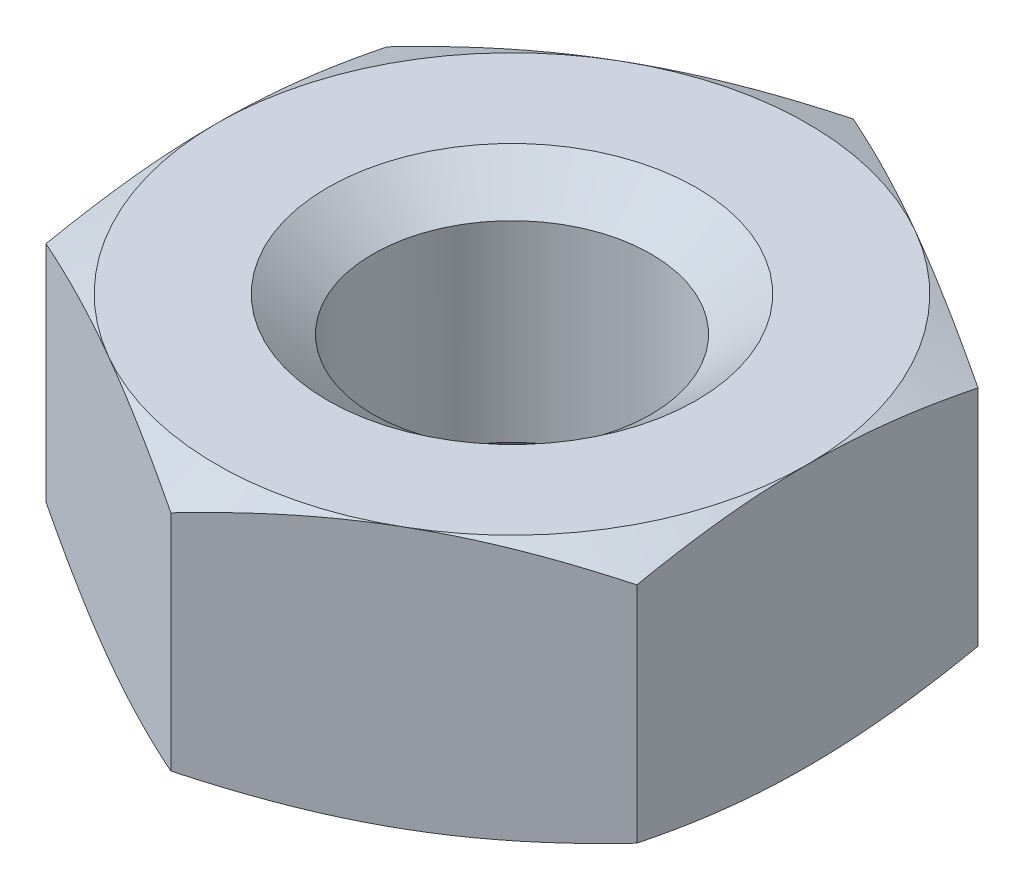
ISO-10303-21;
HEADER;
FILE_DESCRIPTION(('STEP AP214'),'2;1');
FILE_NAME('part.step','',(''),(''),'','','');
FILE_SCHEMA(('AUTOMOTIVE_DESIGN { 1 0 10303 214 1 1 1 1 }'));
ENDSEC;
DATA;
#1=APPLICATION_CONTEXT('core data for automotive mechanical design processes');
#2=APPLICATION_PROTOCOL_DEFINITION('international standard','automotive_design',2000,#1);
#3=PRODUCT_CONTEXT('',#1,'mechanical');
#4=PRODUCT('Part','Part','',(#3));
#5=PRODUCT_RELATED_PRODUCT_CATEGORY('part','',(#4));
#6=PRODUCT_DEFINITION_FORMATION('','',#4);
#7=PRODUCT_DEFINITION_CONTEXT('part definition',#1,'design');
#8=PRODUCT_DEFINITION('design','',#6,#7);
#9=PRODUCT_DEFINITION_SHAPE('','',#8);
#10=(LENGTH_UNIT() NAMED_UNIT(*) SI_UNIT(.MILLI.,.METRE.));
#11=(NAMED_UNIT(*) PLANE_ANGLE_UNIT() SI_UNIT($,.RADIAN.));
#12=(NAMED_UNIT(*) SI_UNIT($,.STERADIAN.) SOLID_ANGLE_UNIT());
#13=UNCERTAINTY_MEASURE_WITH_UNIT(LENGTH_MEASURE(1.E-05),#10,'distance_accuracy_value','');
#14=(GEOMETRIC_REPRESENTATION_CONTEXT(3) GLOBAL_UNCERTAINTY_ASSIGNED_CONTEXT((#13)) GLOBAL_UNIT_ASSIGNED_CONTEXT((#10,
#11,#12)) REPRESENTATION_CONTEXT('',''));
#15=CARTESIAN_POINT('',(0.,0.,0.));
#16=DIRECTION('',(0.,0.,1.));
#17=DIRECTION('',(1.,0.,0.));
#18=AXIS2_PLACEMENT_3D('',#15,#16,#17);
#19=CARTESIAN_POINT('',(0.,-1.52500000000001,0.));
#20=DIRECTION('',(0.,1.,0.));
#21=DIRECTION('',(0.,0.,1.));
#22=AXIS2_PLACEMENT_3D('',#19,#20,#21);
#23=CONICAL_SURFACE('',#22,3.44499999999997,1.17809724509618);
#24=CARTESIAN_POINT('',(3.44499999999999,-1.52500000000001,0.));
#25=CARTESIAN_POINT('',(3.44499999999999,-1.52500653519659,-0.0836770238553707));
#26=CARTESIAN_POINT('',(3.44499999999999,-1.523736539951,-0.167348336923047));
#27=CARTESIAN_POINT('',(3.44499999999999,-1.51869977778039,-0.334608821328024));
#28=CARTESIAN_POINT('',(3.44499999999999,-1.51493322636125,-0.418197999131677));
#29=CARTESIAN_POINT('',(3.44499999999999,-1.50000011813595,-0.668300761406539));
#30=CARTESIAN_POINT('',(3.44499999999999,-1.48519949166168,-0.834608265477263));
#31=CARTESIAN_POINT('',(3.44499999999999,-1.44691557663054,-1.16608574327092));
#32=CARTESIAN_POINT('',(3.44499999999999,-1.42343721863474,-1.33125630880567));
#33=CARTESIAN_POINT('',(3.44499999999999,-1.36907122689802,-1.66083827114248));
#34=CARTESIAN_POINT('',(3.44499999999999,-1.33816390417375,-1.82524644688072));
#35=CARTESIAN_POINT('',(3.44499999999999,-1.30424763449981,-1.98897167735825));
#36=B_SPLINE_CURVE_WITH_KNOTS('',3,(#24,#25,#26,#27,#28,#29,#30,#31,#32,#33,#34,#35),
.UNSPECIFIED.,.F.,.F.,(4,2,2,2,2,4),(0.,0.251010681069905,0.501999697400777,1.00260384828627,
1.50292399932506,2.00458506025341),.UNSPECIFIED.);
#37=CARTESIAN_POINT('',(3.44499999999999,-1.525,0.));
#38=VERTEX_POINT('',#37);
#39=CARTESIAN_POINT('',(3.44499999999999,-1.30424763449981,-1.98897167735825));
#40=VERTEX_POINT('',#39);
#41=EDGE_CURVE('E251',#38,#40,#36,.T.);
#42=ORIENTED_EDGE('',*,*,#41,.F.);
#43=CARTESIAN_POINT('',(0.,-1.525,0.));
#44=DIRECTION('',(0.,1.,0.));
#45=DIRECTION('',(0.,0.,1.));
#46=AXIS2_PLACEMENT_3D('',#43,#44,#45);
#47=CIRCLE('',#46,3.44499999999998);
#48=CARTESIAN_POINT('',(1.7225,-1.525,-2.98345751603738));
#49=VERTEX_POINT('',#48);
#50=EDGE_CURVE('E113',#49,#38,#47,.F.);
#51=ORIENTED_EDGE('',*,*,#50,.F.);
#52=CARTESIAN_POINT('',(3.44499999999998,-1.30424763449981,-1.98897167735824));
#53=CARTESIAN_POINT('',(3.30320979116598,-1.33816390417375,-2.07083429259701));
#54=CARTESIAN_POINT('',(3.16082813438681,-1.36907122689802,-2.15303838046613));
#55=CARTESIAN_POINT('',(2.875401782374,-1.42343721863474,-2.31782936163454));
#56=CARTESIAN_POINT('',(2.73235987666347,-1.44691557663055,-2.40041464440191));
#57=CARTESIAN_POINT('',(2.44529196011177,-1.48519949166168,-2.56615338329874));
#58=CARTESIAN_POINT('',(2.30126543674653,-1.50000011813595,-2.6493071353341));
#59=CARTESIAN_POINT('',(2.08467009105984,-1.51493322636125,-2.77435851647153));
#60=CARTESIAN_POINT('',(2.01227973960043,-1.51869977778039,-2.81615310537336));
#61=CARTESIAN_POINT('',(1.86742791105642,-1.52373653995101,-2.89978334757585));
#62=CARTESIAN_POINT('',(1.79496642837181,-1.52500653519659,-2.94161900410969));
#63=CARTESIAN_POINT('',(1.72249999999999,-1.52500000000001,-2.98345751603737));
#64=B_SPLINE_CURVE_WITH_KNOTS('',3,(#52,#53,#54,#55,#56,#57,#58,#59,#60,#61,#62,#63),
.UNSPECIFIED.,.F.,.F.,(4,2,2,2,2,4),(0.,0.501661060928354,1.00198121196715,1.50258536285264,
1.75357437918352,2.00458506025342),.UNSPECIFIED.);
#65=EDGE_CURVE('E250',#40,#49,#64,.T.);
#66=ORIENTED_EDGE('',*,*,#65,.F.);
#67=EDGE_LOOP('',(#42,#51,#66));
#68=FACE_BOUND('',#67,.T.);
#69=ADVANCED_FACE('F16',(#68),#23,.T.);
#70=CARTESIAN_POINT('',(0.,-1.11908402335913,0.));
#71=DIRECTION('',(0.,-1.,0.));
#72=DIRECTION('',(0.,0.,-1.));
#73=AXIS2_PLACEMENT_3D('',#70,#71,#72);
#74=CONICAL_SURFACE('',#73,1.621,0.916297857297024);
#75=CARTESIAN_POINT('',(0.,-1.11908402335913,0.));
#76=DIRECTION('',(0.,-1.,0.));
#77=DIRECTION('',(0.,0.,-1.));
#78=AXIS2_PLACEMENT_3D('',#75,#76,#77);
#79=CIRCLE('',#78,1.621);
#80=CARTESIAN_POINT('',(0.,-1.11908402335913,-1.621));
#81=VERTEX_POINT('',#80);
#82=EDGE_CURVE('E245',#81,#81,#79,.T.);
#83=ORIENTED_EDGE('',*,*,#82,.F.);
#84=EDGE_LOOP('',(#83));
#85=FACE_BOUND('',#84,.T.);
#86=CARTESIAN_POINT('',(0.,-1.525,0.));
#87=DIRECTION('',(0.,-1.,0.));
#88=DIRECTION('',(0.,0.,-1.));
#89=AXIS2_PLACEMENT_3D('',#86,#87,#88);
#90=CIRCLE('',#89,2.15);
#91=CARTESIAN_POINT('',(0.,-1.525,-2.15));
#92=VERTEX_POINT('',#91);
#93=EDGE_CURVE('E356',#92,#92,#90,.F.);
#94=ORIENTED_EDGE('',*,*,#93,.F.);
#95=EDGE_LOOP('',(#94));
#96=FACE_BOUND('',#95,.T.);
#97=ADVANCED_FACE('F526',(#85,#96),#74,.F.);
#98=CARTESIAN_POINT('',(0.,-1.52500000000001,0.));
#99=DIRECTION('',(0.,1.,0.));
#100=DIRECTION('',(0.,0.,1.));
#101=AXIS2_PLACEMENT_3D('',#98,#99,#100);
#102=CONICAL_SURFACE('',#101,3.44499999999995,1.17809724509617);
#103=CARTESIAN_POINT('',(0.,-1.525,0.));
#104=DIRECTION('',(0.,1.,0.));
#105=DIRECTION('',(0.,0.,1.));
#106=AXIS2_PLACEMENT_3D('',#103,#104,#105);
#107=CIRCLE('',#106,3.44499999999998);
#108=CARTESIAN_POINT('',(-1.72249999999999,-1.525,-2.9834575160374));
#109=VERTEX_POINT('',#108);
#110=EDGE_CURVE('E21',#109,#49,#107,.F.);
#111=ORIENTED_EDGE('',*,*,#110,.F.);
#112=CARTESIAN_POINT('',(0.,-1.3042476344998,-3.97794335471651));
#113=CARTESIAN_POINT('',(-0.141790208834029,-1.33816390417374,-3.89608073947775));
#114=CARTESIAN_POINT('',(-0.284171865613201,-1.36907122689801,-3.81387665160863));
#115=CARTESIAN_POINT('',(-0.569598217625999,-1.42343721863473,-3.64908567044023));
#116=CARTESIAN_POINT('',(-0.712640123336535,-1.44691557663054,-3.56650038767285));
#117=CARTESIAN_POINT('',(-0.99970803988823,-1.48519949166167,-3.40076164877602));
#118=CARTESIAN_POINT('',(-1.14373456325346,-1.50000011813594,-3.31760789674066));
#119=CARTESIAN_POINT('',(-1.36032990894015,-1.51493322636124,-3.19255651560323));
#120=CARTESIAN_POINT('',(-1.43272026039957,-1.51869977778038,-3.15076192670141));
#121=CARTESIAN_POINT('',(-1.57757208894356,-1.523736539951,-3.06713168449892));
#122=CARTESIAN_POINT('',(-1.65003357162817,-1.52500653519658,-3.02529602796508));
#123=CARTESIAN_POINT('',(-1.7225,-1.525,-2.9834575160374));
#124=B_SPLINE_CURVE_WITH_KNOTS('',3,(#112,#113,#114,#115,#116,#117,#118,#119,#120,#121,#122,
#123),.UNSPECIFIED.,.F.,.F.,(4,2,2,2,2,4),(0.,0.501661060928347,1.00198121196714,
1.50258536285262,1.75357437918349,2.0045850602534),.UNSPECIFIED.);
#125=CARTESIAN_POINT('',(0.,-1.3042476344998,-3.97794335471651));
#126=VERTEX_POINT('',#125);
#127=EDGE_CURVE('E108',#126,#109,#124,.T.);
#128=ORIENTED_EDGE('',*,*,#127,.F.);
#129=CARTESIAN_POINT('',(1.72249999999999,-1.52500000000001,-2.98345751603737));
#130=CARTESIAN_POINT('',(1.65003357162816,-1.52500653519659,-3.02529602796506));
#131=CARTESIAN_POINT('',(1.57757208894355,-1.52373653995101,-3.0671316844989));
#132=CARTESIAN_POINT('',(1.43272026039955,-1.51869977778039,-3.15076192670139));
#133=CARTESIAN_POINT('',(1.36032990894013,-1.51493322636125,-3.19255651560321));
#134=CARTESIAN_POINT('',(1.14373456325343,-1.50000011813595,-3.31760789674065));
#135=CARTESIAN_POINT('',(0.999708039888201,-1.48519949166168,-3.40076164877601));
#136=CARTESIAN_POINT('',(0.712640123336499,-1.44691557663054,-3.56650038767284));
#137=CARTESIAN_POINT('',(0.569598217625959,-1.42343721863474,-3.64908567044022));
#138=CARTESIAN_POINT('',(0.284171865613155,-1.36907122689801,-3.81387665160862));
#139=CARTESIAN_POINT('',(0.14179020883398,-1.33816390417374,-3.89608073947775));
#140=CARTESIAN_POINT('',(0.,-1.3042476344998,-3.97794335471651));
#141=B_SPLINE_CURVE_WITH_KNOTS('',3,(#129,#130,#131,#132,#133,#134,#135,#136,#137,#138,#139,
#140),.UNSPECIFIED.,.F.,.F.,(4,2,2,2,2,4),(0.,0.251010681069908,0.501999697400784,
1.00260384828628,1.50292399932508,2.00458506025344),.UNSPECIFIED.);
#142=EDGE_CURVE('E110',#49,#126,#141,.T.);
#143=ORIENTED_EDGE('',*,*,#142,.F.);
#144=EDGE_LOOP('',(#111,#128,#143));
#145=FACE_BOUND('',#144,.T.);
#146=ADVANCED_FACE('F107',(#145),#102,.T.);
#147=CARTESIAN_POINT('',(-3.455,-1.525,3.98794335471652));
#148=DIRECTION('',(0.,-1.,0.));
#149=DIRECTION('',(0.,0.,-1.));
#150=AXIS2_PLACEMENT_3D('',#147,#148,#149);
#151=PLANE('',#150);
#152=ORIENTED_EDGE('',*,*,#93,.T.);
#153=EDGE_LOOP('',(#152));
#154=FACE_BOUND('',#153,.T.);
#155=CARTESIAN_POINT('',(0.,-1.52500000000001,0.));
#156=DIRECTION('',(0.,1.,0.));
#157=DIRECTION('',(0.,0.,1.));
#158=AXIS2_PLACEMENT_3D('',#155,#156,#157);
#159=CIRCLE('',#158,3.44499999999998);
#160=CARTESIAN_POINT('',(1.7225,-1.525,2.98345751603739));
#161=VERTEX_POINT('',#160);
#162=EDGE_CURVE('E347',#161,#38,#159,.T.);
#163=ORIENTED_EDGE('',*,*,#162,.F.);
#164=CARTESIAN_POINT('',(0.,-1.525,0.));
#165=DIRECTION('',(0.,1.,0.));
#166=DIRECTION('',(0.,0.,1.));
#167=AXIS2_PLACEMENT_3D('',#164,#165,#166);
#168=CIRCLE('',#167,3.44499999999999);
#169=CARTESIAN_POINT('',(-1.72249999999999,-1.525,2.98345751603741));
#170=VERTEX_POINT('',#169);
#171=EDGE_CURVE('E376',#170,#161,#168,.T.);
#172=ORIENTED_EDGE('',*,*,#171,.F.);
#173=CARTESIAN_POINT('',(0.,-1.525,0.));
#174=DIRECTION('',(0.,1.,0.));
#175=DIRECTION('',(0.,0.,1.));
#176=AXIS2_PLACEMENT_3D('',#173,#174,#175);
#177=CIRCLE('',#176,3.44500000000002);
#178=CARTESIAN_POINT('',(-3.44500000000001,-1.52499999999999,0.));
#179=VERTEX_POINT('',#178);
#180=EDGE_CURVE('E127',#179,#170,#177,.T.);
#181=ORIENTED_EDGE('',*,*,#180,.F.);
#182=CARTESIAN_POINT('',(0.,-1.525,0.));
#183=DIRECTION('',(0.,1.,0.));
#184=DIRECTION('',(0.,0.,1.));
#185=AXIS2_PLACEMENT_3D('',#182,#183,#184);
#186=CIRCLE('',#185,3.44500000000002);
#187=EDGE_CURVE('E124',#109,#179,#186,.T.);
#188=ORIENTED_EDGE('',*,*,#187,.F.);
#189=ORIENTED_EDGE('',*,*,#110,.T.);
#190=ORIENTED_EDGE('',*,*,#50,.T.);
#191=EDGE_LOOP('',(#163,#172,#181,#188,#189,#190));
#192=FACE_BOUND('',#191,.T.);
#193=ADVANCED_FACE('F125',(#154,#192),#151,.T.);
#194=CARTESIAN_POINT('',(0.,-1.52500000000001,0.));
#195=DIRECTION('',(0.,1.,0.));
#196=DIRECTION('',(0.,0.,1.));
#197=AXIS2_PLACEMENT_3D('',#194,#195,#196);
#198=CONICAL_SURFACE('',#197,3.44499999999998,1.17809724509616);
#199=CARTESIAN_POINT('',(1.7225,-1.525,2.9834575160374));
#200=CARTESIAN_POINT('',(1.79496642837183,-1.52500653519658,2.94161900410971));
#201=CARTESIAN_POINT('',(1.86742791105644,-1.523736539951,2.89978334757587));
#202=CARTESIAN_POINT('',(2.01227973960044,-1.51869977778038,2.81615310537339));
#203=CARTESIAN_POINT('',(2.08467009105986,-1.51493322636124,2.77435851647156));
#204=CARTESIAN_POINT('',(2.30126543674655,-1.50000011813594,2.64930713533413));
#205=CARTESIAN_POINT('',(2.44529196011178,-1.48519949166167,2.56615338329877));
#206=CARTESIAN_POINT('',(2.73235987666347,-1.44691557663053,2.40041464440194));
#207=CARTESIAN_POINT('',(2.87540178237401,-1.42343721863473,2.31782936163457));
#208=CARTESIAN_POINT('',(3.16082813438681,-1.36907122689801,2.15303838046617));
#209=CARTESIAN_POINT('',(3.30320979116598,-1.33816390417373,2.07083429259705));
#210=CARTESIAN_POINT('',(3.44499999999999,-1.3042476344998,1.98897167735828));
#211=B_SPLINE_CURVE_WITH_KNOTS('',3,(#199,#200,#201,#202,#203,#204,#205,#206,#207,#208,#209,
#210),.UNSPECIFIED.,.F.,.F.,(4,2,2,2,2,4),(0.,0.251010681069903,0.501999697400774,
1.00260384828626,1.50292399932505,2.0045850602534),.UNSPECIFIED.);
#212=CARTESIAN_POINT('',(3.44499999999999,-1.3042476344998,1.98897167735828));
#213=VERTEX_POINT('',#212);
#214=EDGE_CURVE('E243',#161,#213,#211,.T.);
#215=ORIENTED_EDGE('',*,*,#214,.F.);
#216=ORIENTED_EDGE('',*,*,#162,.T.);
#217=CARTESIAN_POINT('',(3.44499999999999,-1.3042476344998,1.98897167735828));
#218=CARTESIAN_POINT('',(3.44499999999999,-1.33816390417374,1.82524644688074));
#219=CARTESIAN_POINT('',(3.44499999999999,-1.36907122689801,1.6608382711425));
#220=CARTESIAN_POINT('',(3.44499999999999,-1.42343721863473,1.33125630880569));
#221=CARTESIAN_POINT('',(3.44499999999999,-1.44691557663054,1.16608574327093));
#222=CARTESIAN_POINT('',(3.44499999999999,-1.48519949166168,0.834608265477274));
#223=CARTESIAN_POINT('',(3.44499999999999,-1.50000011813595,0.668300761406547));
#224=CARTESIAN_POINT('',(3.44499999999999,-1.51493322636125,0.418197999131681));
#225=CARTESIAN_POINT('',(3.44499999999999,-1.51869977778039,0.334608821328027));
#226=CARTESIAN_POINT('',(3.44499999999999,-1.52373653995101,0.167348336923048));
#227=CARTESIAN_POINT('',(3.44499999999999,-1.52500653519659,0.0836770238553703));
#228=CARTESIAN_POINT('',(3.44499999999999,-1.52500000000001,0.));
#229=B_SPLINE_CURVE_WITH_KNOTS('',3,(#217,#218,#219,#220,#221,#222,#223,#224,#225,#226,#227,
#228),.UNSPECIFIED.,.F.,.F.,(4,2,2,2,2,4),(0.,0.501661060928359,1.00198121196716,
1.50258536285266,1.75357437918354,2.00458506025344),.UNSPECIFIED.);
#230=EDGE_CURVE('E339',#213,#38,#229,.T.);
#231=ORIENTED_EDGE('',*,*,#230,.F.);
#232=EDGE_LOOP('',(#215,#216,#231));
#233=FACE_BOUND('',#232,.T.);
#234=ADVANCED_FACE('F330',(#233),#198,.T.);
#235=CARTESIAN_POINT('',(3.44499999999999,-1.53500000000001,1.99897167735828));
#236=DIRECTION('',(1.,0.,0.));
#237=DIRECTION('',(0.,0.,-1.));
#238=AXIS2_PLACEMENT_3D('',#235,#236,#237);
#239=PLANE('',#238);
#240=ORIENTED_EDGE('',*,*,#41,.T.);
#241=DIRECTION('',(0.,-1.,0.));
#242=VECTOR('',#241,1.);
#243=CARTESIAN_POINT('',(3.44499999999998,0.,-1.98897167735824));
#244=LINE('',#243,#242);
#245=CARTESIAN_POINT('',(3.44499999999998,1.30424763449981,-1.98897167735824));
#246=VERTEX_POINT('',#245);
#247=EDGE_CURVE('E248',#246,#40,#244,.T.);
#248=ORIENTED_EDGE('',*,*,#247,.F.);
#249=CARTESIAN_POINT('',(3.44499999999999,1.525,0.));
#250=CARTESIAN_POINT('',(3.44499999999999,1.52500653519659,-0.0836770238553706));
#251=CARTESIAN_POINT('',(3.44499999999999,1.523736539951,-0.167348336923047));
#252=CARTESIAN_POINT('',(3.44499999999999,1.51869977778038,-0.334608821328024));
#253=CARTESIAN_POINT('',(3.44499999999999,1.51493322636125,-0.418197999131677));
#254=CARTESIAN_POINT('',(3.44499999999999,1.50000011813594,-0.668300761406538));
#255=CARTESIAN_POINT('',(3.44499999999999,1.48519949166168,-0.834608265477262));
#256=CARTESIAN_POINT('',(3.44499999999999,1.44691557663054,-1.16608574327092));
#257=CARTESIAN_POINT('',(3.44499999999999,1.42343721863474,-1.33125630880567));
#258=CARTESIAN_POINT('',(3.44499999999999,1.36907122689801,-1.66083827114248));
#259=CARTESIAN_POINT('',(3.44499999999999,1.33816390417374,-1.82524644688072));
#260=CARTESIAN_POINT('',(3.44499999999999,1.30424763449981,-1.98897167735825));
#261=B_SPLINE_CURVE_WITH_KNOTS('',3,(#249,#250,#251,#252,#253,#254,#255,#256,#257,#258,#259,
#260),.UNSPECIFIED.,.F.,.F.,(4,2,2,2,2,4),(0.,0.251010681069904,0.501999697400776,
1.00260384828627,1.50292399932506,2.00458506025341),.UNSPECIFIED.);
#262=CARTESIAN_POINT('',(3.44499999999999,1.525,0.));
#263=VERTEX_POINT('',#262);
#264=EDGE_CURVE('E419',#263,#246,#261,.T.);
#265=ORIENTED_EDGE('',*,*,#264,.F.);
#266=CARTESIAN_POINT('',(3.44499999999999,1.3042476344998,1.98897167735828));
#267=CARTESIAN_POINT('',(3.44499999999999,1.33816390417373,1.82524644688074));
#268=CARTESIAN_POINT('',(3.44499999999999,1.36907122689801,1.6608382711425));
#269=CARTESIAN_POINT('',(3.44499999999999,1.42343721863473,1.33125630880569));
#270=CARTESIAN_POINT('',(3.44499999999999,1.44691557663054,1.16608574327093));
#271=CARTESIAN_POINT('',(3.44499999999999,1.48519949166168,0.834608265477274));
#272=CARTESIAN_POINT('',(3.44499999999999,1.50000011813595,0.668300761406548));
#273=CARTESIAN_POINT('',(3.44499999999999,1.51493322636125,0.418197999131682));
#274=CARTESIAN_POINT('',(3.44499999999999,1.51869977778039,0.334608821328027));
#275=CARTESIAN_POINT('',(3.44499999999999,1.52373653995101,0.167348336923048));
#276=CARTESIAN_POINT('',(3.44499999999999,1.52500653519659,0.0836770238553703));
#277=CARTESIAN_POINT('',(3.44499999999999,1.52500000000001,0.));
#278=B_SPLINE_CURVE_WITH_KNOTS('',3,(#266,#267,#268,#269,#270,#271,#272,#273,#274,#275,#276,
#277),.UNSPECIFIED.,.F.,.F.,(4,2,2,2,2,4),(0.,0.50166106092836,1.00198121196716,
1.50258536285266,1.75357437918354,2.00458506025345),.UNSPECIFIED.);
#279=CARTESIAN_POINT('',(3.44499999999999,1.3042476344998,1.98897167735828));
#280=VERTEX_POINT('',#279);
#281=EDGE_CURVE('E310',#280,#263,#278,.T.);
#282=ORIENTED_EDGE('',*,*,#281,.F.);
#283=DIRECTION('',(0.,1.,0.));
#284=VECTOR('',#283,1.);
#285=CARTESIAN_POINT('',(3.44499999999999,0.,1.98897167735828));
#286=LINE('',#285,#284);
#287=EDGE_CURVE('E239',#213,#280,#286,.T.);
#288=ORIENTED_EDGE('',*,*,#287,.F.);
#289=ORIENTED_EDGE('',*,*,#230,.T.);
#290=EDGE_LOOP('',(#240,#248,#265,#282,#288,#289));
#291=FACE_BOUND('',#290,.T.);
#292=ADVANCED_FACE('F334',(#291),#239,.T.);
#293=CARTESIAN_POINT('',(3.45366025403781,-1.53500000000001,-1.98397167735825));
#294=DIRECTION('',(0.5,0.,-0.866025403784438));
#295=DIRECTION('',(-0.866025403784438,0.,-0.5));
#296=AXIS2_PLACEMENT_3D('',#293,#294,#295);
#297=PLANE('',#296);
#298=ORIENTED_EDGE('',*,*,#142,.T.);
#299=DIRECTION('',(0.,-1.,0.));
#300=VECTOR('',#299,1.);
#301=CARTESIAN_POINT('',(0.,0.,-3.97794335471651));
#302=LINE('',#301,#300);
#303=CARTESIAN_POINT('',(0.,1.3042476344998,-3.97794335471651));
#304=VERTEX_POINT('',#303);
#305=EDGE_CURVE('E121',#304,#126,#302,.T.);
#306=ORIENTED_EDGE('',*,*,#305,.F.);
#307=CARTESIAN_POINT('',(1.72249999999999,1.52500000000001,-2.98345751603737));
#308=CARTESIAN_POINT('',(1.65003357162816,1.52500653519659,-3.02529602796506));
#309=CARTESIAN_POINT('',(1.57757208894355,1.52373653995101,-3.0671316844989));
#310=CARTESIAN_POINT('',(1.43272026039955,1.51869977778039,-3.15076192670139));
#311=CARTESIAN_POINT('',(1.36032990894013,1.51493322636125,-3.19255651560321));
#312=CARTESIAN_POINT('',(1.14373456325343,1.50000011813595,-3.31760789674065));
#313=CARTESIAN_POINT('',(0.999708039888201,1.48519949166168,-3.40076164877601));
#314=CARTESIAN_POINT('',(0.712640123336499,1.44691557663054,-3.56650038767284));
#315=CARTESIAN_POINT('',(0.569598217625959,1.42343721863474,-3.64908567044022));
#316=CARTESIAN_POINT('',(0.284171865613155,1.36907122689801,-3.81387665160862));
#317=CARTESIAN_POINT('',(0.14179020883398,1.33816390417374,-3.89608073947775));
#318=CARTESIAN_POINT('',(0.,1.3042476344998,-3.97794335471651));
#319=B_SPLINE_CURVE_WITH_KNOTS('',3,(#307,#308,#309,#310,#311,#312,#313,#314,#315,#316,#317,
#318),.UNSPECIFIED.,.F.,.F.,(4,2,2,2,2,4),(0.,0.251010681069908,0.501999697400784,
1.00260384828628,1.50292399932508,2.00458506025344),.UNSPECIFIED.);
#320=CARTESIAN_POINT('',(1.72249999999999,1.525,-2.98345751603739));
#321=VERTEX_POINT('',#320);
#322=EDGE_CURVE('E177',#321,#304,#319,.T.);
#323=ORIENTED_EDGE('',*,*,#322,.F.);
#324=CARTESIAN_POINT('',(3.44499999999998,1.30424763449981,-1.98897167735824));
#325=CARTESIAN_POINT('',(3.30320979116598,1.33816390417374,-2.07083429259701));
#326=CARTESIAN_POINT('',(3.16082813438681,1.36907122689802,-2.15303838046613));
#327=CARTESIAN_POINT('',(2.875401782374,1.42343721863474,-2.31782936163454));
#328=CARTESIAN_POINT('',(2.73235987666347,1.44691557663054,-2.40041464440191));
#329=CARTESIAN_POINT('',(2.44529196011177,1.48519949166168,-2.56615338329874));
#330=CARTESIAN_POINT('',(2.30126543674653,1.50000011813595,-2.6493071353341));
#331=CARTESIAN_POINT('',(2.08467009105984,1.51493322636125,-2.77435851647153));
#332=CARTESIAN_POINT('',(2.01227973960043,1.51869977778039,-2.81615310537336));
#333=CARTESIAN_POINT('',(1.86742791105642,1.52373653995101,-2.89978334757585));
#334=CARTESIAN_POINT('',(1.79496642837181,1.52500653519659,-2.94161900410969));
#335=CARTESIAN_POINT('',(1.72249999999999,1.52500000000001,-2.98345751603737));
#336=B_SPLINE_CURVE_WITH_KNOTS('',3,(#324,#325,#326,#327,#328,#329,#330,#331,#332,#333,#334,
#335),.UNSPECIFIED.,.F.,.F.,(4,2,2,2,2,4),(0.,0.501661060928354,1.00198121196715,
1.50258536285264,1.75357437918352,2.00458506025342),.UNSPECIFIED.);
#337=EDGE_CURVE('E421',#246,#321,#336,.T.);
#338=ORIENTED_EDGE('',*,*,#337,.F.);
#339=ORIENTED_EDGE('',*,*,#247,.T.);
#340=ORIENTED_EDGE('',*,*,#65,.T.);
#341=EDGE_LOOP('',(#298,#306,#323,#338,#339,#340));
#342=FACE_BOUND('',#341,.T.);
#343=ADVANCED_FACE('F489',(#342),#297,.T.);
#344=CARTESIAN_POINT('',(0.,-1.11908402335913,0.));
#345=DIRECTION('',(0.,1.,0.));
#346=DIRECTION('',(0.,0.,1.));
#347=AXIS2_PLACEMENT_3D('',#344,#345,#346);
#348=CYLINDRICAL_SURFACE('',#347,1.621);
#349=ORIENTED_EDGE('',*,*,#82,.T.);
#350=EDGE_LOOP('',(#349));
#351=FACE_BOUND('',#350,.T.);
#352=CARTESIAN_POINT('',(0.,1.11908402335913,0.));
#353=DIRECTION('',(0.,-1.,0.));
#354=DIRECTION('',(0.,0.,-1.));
#355=AXIS2_PLACEMENT_3D('',#352,#353,#354);
#356=CIRCLE('',#355,1.621);
#357=CARTESIAN_POINT('',(0.,1.11908402335913,-1.621));
#358=VERTEX_POINT('',#357);
#359=EDGE_CURVE('E176',#358,#358,#356,.T.);
#360=ORIENTED_EDGE('',*,*,#359,.F.);
#361=EDGE_LOOP('',(#360));
#362=FACE_BOUND('',#361,.T.);
#363=ADVANCED_FACE('F154',(#351,#362),#348,.F.);
#364=CARTESIAN_POINT('',(0.00866025403781822,-1.535,-3.98294335471651));
#365=DIRECTION('',(-0.500000000000001,0.,-0.866025403784438));
#366=DIRECTION('',(-0.866025403784438,0.,0.500000000000001));
#367=AXIS2_PLACEMENT_3D('',#364,#365,#366);
#368=PLANE('',#367);
#369=DIRECTION('',(0.,-1.,0.));
#370=VECTOR('',#369,1.);
#371=CARTESIAN_POINT('',(-3.44500000000004,0.,-1.98897167735825));
#372=LINE('',#371,#370);
#373=CARTESIAN_POINT('',(-3.44500000000004,1.30424763449979,-1.98897167735825));
#374=VERTEX_POINT('',#373);
#375=CARTESIAN_POINT('',(-3.44500000000004,-1.3042476344998,-1.98897167735825));
#376=VERTEX_POINT('',#375);
#377=EDGE_CURVE('E230',#374,#376,#372,.T.);
#378=ORIENTED_EDGE('',*,*,#377,.F.);
#379=CARTESIAN_POINT('',(-1.7225,1.52499999999999,-2.98345751603739));
#380=CARTESIAN_POINT('',(-1.79496642837183,1.52500653519657,-2.94161900410971));
#381=CARTESIAN_POINT('',(-1.86742791105644,1.52373653995099,-2.89978334757587));
#382=CARTESIAN_POINT('',(-2.01227973960044,1.51869977778037,-2.81615310537338));
#383=CARTESIAN_POINT('',(-2.08467009105986,1.51493322636123,-2.77435851647155));
#384=CARTESIAN_POINT('',(-2.30126543674656,1.50000011813593,-2.64930713533412));
#385=CARTESIAN_POINT('',(-2.44529196011179,1.48519949166166,-2.56615338329875));
#386=CARTESIAN_POINT('',(-2.7323598766635,1.44691557663053,-2.40041464440192));
#387=CARTESIAN_POINT('',(-2.87540178237404,1.42343721863472,-2.31782936163454));
#388=CARTESIAN_POINT('',(-3.16082813438685,1.369071226898,-2.15303838046613));
#389=CARTESIAN_POINT('',(-3.30320979116603,1.33816390417373,-2.07083429259701));
#390=CARTESIAN_POINT('',(-3.44500000000003,1.3042476344998,-1.98897167735824));
#391=B_SPLINE_CURVE_WITH_KNOTS('',3,(#379,#380,#381,#382,#383,#384,#385,#386,#387,#388,#389,
#390),.UNSPECIFIED.,.F.,.F.,(4,2,2,2,2,4),(0.,0.251010681069911,0.50199969740079,
1.0026038482863,1.5029239993251,2.00458506025347),.UNSPECIFIED.);
#392=CARTESIAN_POINT('',(-1.7225,1.52499999999999,-2.98345751603739));
#393=VERTEX_POINT('',#392);
#394=EDGE_CURVE('E169',#393,#374,#391,.T.);
#395=ORIENTED_EDGE('',*,*,#394,.F.);
#396=CARTESIAN_POINT('',(0.,1.3042476344998,-3.97794335471651));
#397=CARTESIAN_POINT('',(-0.14179020883403,1.33816390417374,-3.89608073947775));
#398=CARTESIAN_POINT('',(-0.284171865613202,1.36907122689801,-3.81387665160863));
#399=CARTESIAN_POINT('',(-0.569598217625999,1.42343721863473,-3.64908567044023));
#400=CARTESIAN_POINT('',(-0.712640123336535,1.44691557663054,-3.56650038767285));
#401=CARTESIAN_POINT('',(-0.999708039888231,1.48519949166167,-3.40076164877602));
#402=CARTESIAN_POINT('',(-1.14373456325346,1.50000011813594,-3.31760789674066));
#403=CARTESIAN_POINT('',(-1.36032990894015,1.51493322636124,-3.19255651560323));
#404=CARTESIAN_POINT('',(-1.43272026039957,1.51869977778038,-3.15076192670141));
#405=CARTESIAN_POINT('',(-1.57757208894357,1.523736539951,-3.06713168449892));
#406=CARTESIAN_POINT('',(-1.65003357162817,1.52500653519658,-3.02529602796508));
#407=CARTESIAN_POINT('',(-1.7225,1.525,-2.98345751603739));
#408=B_SPLINE_CURVE_WITH_KNOTS('',3,(#396,#397,#398,#399,#400,#401,#402,#403,#404,#405,#406,
#407),.UNSPECIFIED.,.F.,.F.,(4,2,2,2,2,4),(0.,0.501661060928347,1.00198121196714,
1.50258536285262,1.75357437918349,2.0045850602534),.UNSPECIFIED.);
#409=EDGE_CURVE('E159',#304,#393,#408,.T.);
#410=ORIENTED_EDGE('',*,*,#409,.F.);
#411=ORIENTED_EDGE('',*,*,#305,.T.);
#412=ORIENTED_EDGE('',*,*,#127,.T.);
#413=CARTESIAN_POINT('',(-3.44500000000003,-1.3042476344998,-1.98897167735824));
#414=CARTESIAN_POINT('',(-3.30320979116603,-1.33816390417373,-2.07083429259701));
#415=CARTESIAN_POINT('',(-3.16082813438685,-1.36907122689801,-2.15303838046613));
#416=CARTESIAN_POINT('',(-2.87540178237404,-1.42343721863473,-2.31782936163454));
#417=CARTESIAN_POINT('',(-2.7323598766635,-1.44691557663054,-2.40041464440192));
#418=CARTESIAN_POINT('',(-2.44529196011179,-1.48519949166167,-2.56615338329875));
#419=CARTESIAN_POINT('',(-2.30126543674656,-1.50000011813594,-2.64930713533412));
#420=CARTESIAN_POINT('',(-2.08467009105986,-1.51493322636124,-2.77435851647155));
#421=CARTESIAN_POINT('',(-2.01227973960044,-1.51869977778038,-2.81615310537338));
#422=CARTESIAN_POINT('',(-1.86742791105644,-1.523736539951,-2.89978334757587));
#423=CARTESIAN_POINT('',(-1.79496642837183,-1.52500653519658,-2.94161900410971));
#424=CARTESIAN_POINT('',(-1.7225,-1.525,-2.98345751603739));
#425=B_SPLINE_CURVE_WITH_KNOTS('',3,(#413,#414,#415,#416,#417,#418,#419,#420,#421,#422,#423,
#424),.UNSPECIFIED.,.F.,.F.,(4,2,2,2,2,4),(0.,0.501661060928366,1.00198121196717,
1.50258536285268,1.75357437918356,2.00458506025347),.UNSPECIFIED.);
#426=EDGE_CURVE('E118',#376,#109,#425,.T.);
#427=ORIENTED_EDGE('',*,*,#426,.F.);
#428=EDGE_LOOP('',(#378,#395,#410,#411,#412,#427));
#429=FACE_BOUND('',#428,.T.);
#430=ADVANCED_FACE('F116',(#429),#368,.T.);
#431=CARTESIAN_POINT('',(0.,-1.525,0.));
#432=DIRECTION('',(0.,1.,0.));
#433=DIRECTION('',(0.,0.,1.));
#434=AXIS2_PLACEMENT_3D('',#431,#432,#433);
#435=CONICAL_SURFACE('',#434,3.44500000000002,1.17809724509619);
#436=ORIENTED_EDGE('',*,*,#187,.T.);
#437=CARTESIAN_POINT('',(-3.44500000000004,-1.3042476344998,-1.98897167735825));
#438=CARTESIAN_POINT('',(-3.44500000000004,-1.33816390417373,-1.82524644688072));
#439=CARTESIAN_POINT('',(-3.44500000000004,-1.369071226898,-1.66083827114248));
#440=CARTESIAN_POINT('',(-3.44500000000004,-1.42343721863472,-1.33125630880567));
#441=CARTESIAN_POINT('',(-3.44500000000004,-1.44691557663052,-1.16608574327092));
#442=CARTESIAN_POINT('',(-3.44500000000004,-1.48519949166166,-0.834608265477262));
#443=CARTESIAN_POINT('',(-3.44500000000004,-1.50000011813592,-0.668300761406538));
#444=CARTESIAN_POINT('',(-3.44500000000004,-1.51493322636123,-0.418197999131676));
#445=CARTESIAN_POINT('',(-3.44500000000004,-1.51869977778036,-0.334608821328023));
#446=CARTESIAN_POINT('',(-3.44500000000004,-1.52373653995098,-0.167348336923046));
#447=CARTESIAN_POINT('',(-3.44500000000004,-1.52500653519656,-0.0836770238553699));
#448=CARTESIAN_POINT('',(-3.44500000000004,-1.52499999999998,0.));
#449=B_SPLINE_CURVE_WITH_KNOTS('',3,(#437,#438,#439,#440,#441,#442,#443,#444,#445,#446,#447,
#448),.UNSPECIFIED.,.F.,.F.,(4,2,2,2,2,4),(0.,0.501661060928352,1.00198121196714,
1.50258536285264,1.75357437918351,2.00458506025341),.UNSPECIFIED.);
#450=EDGE_CURVE('E133',#376,#179,#449,.T.);
#451=ORIENTED_EDGE('',*,*,#450,.F.);
#452=ORIENTED_EDGE('',*,*,#426,.T.);
#453=EDGE_LOOP('',(#436,#451,#452));
#454=FACE_BOUND('',#453,.T.);
#455=ADVANCED_FACE('F131',(#454),#435,.T.);
#456=CARTESIAN_POINT('',(0.,-1.525,0.));
#457=DIRECTION('',(0.,1.,0.));
#458=DIRECTION('',(0.,0.,1.));
#459=AXIS2_PLACEMENT_3D('',#456,#457,#458);
#460=CONICAL_SURFACE('',#459,3.44500000000002,1.17809724509616);
#461=ORIENTED_EDGE('',*,*,#180,.T.);
#462=CARTESIAN_POINT('',(-3.44500000000003,-1.30424763449978,1.98897167735827));
#463=CARTESIAN_POINT('',(-3.30320979116603,-1.33816390417372,2.07083429259704));
#464=CARTESIAN_POINT('',(-3.16082813438685,-1.36907122689799,2.15303838046616));
#465=CARTESIAN_POINT('',(-2.87540178237404,-1.42343721863472,2.31782936163457));
#466=CARTESIAN_POINT('',(-2.7323598766635,-1.44691557663052,2.40041464440194));
#467=CARTESIAN_POINT('',(-2.4452919601118,-1.48519949166166,2.56615338329878));
#468=CARTESIAN_POINT('',(-2.30126543674657,-1.50000011813593,2.64930713533414));
#469=CARTESIAN_POINT('',(-2.08467009105987,-1.51493322636124,2.77435851647157));
#470=CARTESIAN_POINT('',(-2.01227973960045,-1.51869977778037,2.8161531053734));
#471=CARTESIAN_POINT('',(-1.86742791105645,-1.52373653995099,2.89978334757589));
#472=CARTESIAN_POINT('',(-1.79496642837184,-1.52500653519658,2.94161900410973));
#473=CARTESIAN_POINT('',(-1.72250000000001,-1.52499999999999,2.98345751603742));
#474=B_SPLINE_CURVE_WITH_KNOTS('',3,(#462,#463,#464,#465,#466,#467,#468,#469,#470,#471,#472,
#473),.UNSPECIFIED.,.F.,.F.,(4,2,2,2,2,4),(0.,0.501661060928363,1.00198121196717,
1.50258536285267,1.75357437918355,2.00458506025346),.UNSPECIFIED.);
#475=CARTESIAN_POINT('',(-3.44500000000003,-1.30424763449978,1.98897167735827));
#476=VERTEX_POINT('',#475);
#477=EDGE_CURVE('E381',#476,#170,#474,.T.);
#478=ORIENTED_EDGE('',*,*,#477,.F.);
#479=CARTESIAN_POINT('',(-3.44500000000004,-1.52499999999998,0.));
#480=CARTESIAN_POINT('',(-3.44500000000004,-1.52500653519657,0.0836770238553709));
#481=CARTESIAN_POINT('',(-3.44500000000004,-1.52373653995098,0.167348336923048));
#482=CARTESIAN_POINT('',(-3.44500000000004,-1.51869977778036,0.334608821328027));
#483=CARTESIAN_POINT('',(-3.44500000000004,-1.51493322636123,0.418197999131681));
#484=CARTESIAN_POINT('',(-3.44500000000004,-1.50000011813592,0.668300761406547));
#485=CARTESIAN_POINT('',(-3.44500000000004,-1.48519949166165,0.834608265477273));
#486=CARTESIAN_POINT('',(-3.44500000000004,-1.44691557663052,1.16608574327093));
#487=CARTESIAN_POINT('',(-3.44500000000004,-1.42343721863471,1.33125630880569));
#488=CARTESIAN_POINT('',(-3.44500000000004,-1.36907122689799,1.6608382711425));
#489=CARTESIAN_POINT('',(-3.44500000000004,-1.33816390417372,1.82524644688074));
#490=CARTESIAN_POINT('',(-3.44500000000004,-1.30424763449978,1.98897167735827));
#491=B_SPLINE_CURVE_WITH_KNOTS('',3,(#479,#480,#481,#482,#483,#484,#485,#486,#487,#488,#489,
#490),.UNSPECIFIED.,.F.,.F.,(4,2,2,2,2,4),(0.,0.251010681069908,0.501999697400783,
1.00260384828628,1.50292399932508,2.00458506025344),.UNSPECIFIED.);
#492=EDGE_CURVE('E220',#179,#476,#491,.T.);
#493=ORIENTED_EDGE('',*,*,#492,.F.);
#494=EDGE_LOOP('',(#461,#478,#493));
#495=FACE_BOUND('',#494,.T.);
#496=ADVANCED_FACE('F379',(#495),#460,.T.);
#497=CARTESIAN_POINT('',(0.,-1.525,0.));
#498=DIRECTION('',(0.,1.,0.));
#499=DIRECTION('',(0.,0.,1.));
#500=AXIS2_PLACEMENT_3D('',#497,#498,#499);
#501=CONICAL_SURFACE('',#500,3.44499999999999,1.17809724509616);
#502=CARTESIAN_POINT('',(-1.72250000000001,-1.52499999999999,2.98345751603742));
#503=CARTESIAN_POINT('',(-1.65003357162818,-1.52500653519657,3.0252960279651));
#504=CARTESIAN_POINT('',(-1.57757208894357,-1.52373653995099,3.06713168449894));
#505=CARTESIAN_POINT('',(-1.43272026039957,-1.51869977778037,3.15076192670143));
#506=CARTESIAN_POINT('',(-1.36032990894015,-1.51493322636124,3.19255651560325));
#507=CARTESIAN_POINT('',(-1.14373456325346,-1.50000011813593,3.31760789674068));
#508=CARTESIAN_POINT('',(-0.999708039888232,-1.48519949166166,3.40076164877605));
#509=CARTESIAN_POINT('',(-0.712640123336534,-1.44691557663053,3.56650038767287));
#510=CARTESIAN_POINT('',(-0.569598217625997,-1.42343721863472,3.64908567044025));
#511=CARTESIAN_POINT('',(-0.284171865613196,-1.369071226898,3.81387665160865));
#512=CARTESIAN_POINT('',(-0.141790208834023,-1.33816390417373,3.89608073947777));
#513=CARTESIAN_POINT('',(0.,-1.30424763449979,3.97794335471654));
#514=B_SPLINE_CURVE_WITH_KNOTS('',3,(#502,#503,#504,#505,#506,#507,#508,#509,#510,#511,#512,
#513),.UNSPECIFIED.,.F.,.F.,(4,2,2,2,2,4),(0.,0.251010681069905,0.501999697400777,
1.00260384828627,1.50292399932506,2.00458506025341),.UNSPECIFIED.);
#515=CARTESIAN_POINT('',(0.,-1.30424763449979,3.97794335471654));
#516=VERTEX_POINT('',#515);
#517=EDGE_CURVE('E287',#170,#516,#514,.T.);
#518=ORIENTED_EDGE('',*,*,#517,.F.);
#519=ORIENTED_EDGE('',*,*,#171,.T.);
#520=CARTESIAN_POINT('',(0.,-1.30424763449979,3.97794335471654));
#521=CARTESIAN_POINT('',(0.141790208833985,-1.33816390417373,3.89608073947777));
#522=CARTESIAN_POINT('',(0.284171865613161,-1.369071226898,3.81387665160865));
#523=CARTESIAN_POINT('',(0.569598217625967,-1.42343721863473,3.64908567044024));
#524=CARTESIAN_POINT('',(0.712640123336508,-1.44691557663054,3.56650038767287));
#525=CARTESIAN_POINT('',(0.999708039888212,-1.48519949166167,3.40076164877603));
#526=CARTESIAN_POINT('',(1.14373456325345,-1.50000011813594,3.31760789674067));
#527=CARTESIAN_POINT('',(1.36032990894014,-1.51493322636125,3.19255651560324));
#528=CARTESIAN_POINT('',(1.43272026039956,-1.51869977778038,3.15076192670141));
#529=CARTESIAN_POINT('',(1.57757208894357,-1.523736539951,3.06713168449892));
#530=CARTESIAN_POINT('',(1.65003357162818,-1.52500653519659,3.02529602796508));
#531=CARTESIAN_POINT('',(1.7225,-1.525,2.9834575160374));
#532=B_SPLINE_CURVE_WITH_KNOTS('',3,(#520,#521,#522,#523,#524,#525,#526,#527,#528,#529,#530,
#531),.UNSPECIFIED.,.F.,.F.,(4,2,2,2,2,4),(0.,0.501661060928362,1.00198121196717,
1.50258536285267,1.75357437918355,2.00458506025346),.UNSPECIFIED.);
#533=EDGE_CURVE('E324',#516,#161,#532,.T.);
#534=ORIENTED_EDGE('',*,*,#533,.F.);
#535=EDGE_LOOP('',(#518,#519,#534));
#536=FACE_BOUND('',#535,.T.);
#537=ADVANCED_FACE('F383',(#536),#501,.T.);
#538=CARTESIAN_POINT('',(-0.00866025403786628,-1.535,3.98294335471654));
#539=DIRECTION('',(0.499999999999998,0.,0.866025403784439));
#540=DIRECTION('',(0.866025403784439,0.,-0.499999999999998));
#541=AXIS2_PLACEMENT_3D('',#538,#539,#540);
#542=PLANE('',#541);
#543=ORIENTED_EDGE('',*,*,#214,.T.);
#544=ORIENTED_EDGE('',*,*,#287,.T.);
#545=CARTESIAN_POINT('',(1.7225,1.525,2.9834575160374));
#546=CARTESIAN_POINT('',(1.79496642837183,1.52500653519658,2.94161900410971));
#547=CARTESIAN_POINT('',(1.86742791105644,1.523736539951,2.89978334757587));
#548=CARTESIAN_POINT('',(2.01227973960044,1.51869977778038,2.81615310537339));
#549=CARTESIAN_POINT('',(2.08467009105986,1.51493322636124,2.77435851647156));
#550=CARTESIAN_POINT('',(2.30126543674655,1.50000011813594,2.64930713533413));
#551=CARTESIAN_POINT('',(2.44529196011178,1.48519949166167,2.56615338329877));
#552=CARTESIAN_POINT('',(2.73235987666347,1.44691557663053,2.40041464440194));
#553=CARTESIAN_POINT('',(2.87540178237401,1.42343721863473,2.31782936163457));
#554=CARTESIAN_POINT('',(3.16082813438681,1.36907122689801,2.15303838046617));
#555=CARTESIAN_POINT('',(3.30320979116598,1.33816390417373,2.07083429259705));
#556=CARTESIAN_POINT('',(3.44499999999998,1.3042476344998,1.98897167735828));
#557=B_SPLINE_CURVE_WITH_KNOTS('',3,(#545,#546,#547,#548,#549,#550,#551,#552,#553,#554,#555,
#556),.UNSPECIFIED.,.F.,.F.,(4,2,2,2,2,4),(0.,0.251010681069903,0.501999697400774,
1.00260384828626,1.50292399932505,2.0045850602534),.UNSPECIFIED.);
#558=CARTESIAN_POINT('',(1.7225,1.525,2.9834575160374));
#559=VERTEX_POINT('',#558);
#560=EDGE_CURVE('E413',#559,#280,#557,.T.);
#561=ORIENTED_EDGE('',*,*,#560,.F.);
#562=CARTESIAN_POINT('',(0.,1.30424763449979,3.97794335471654));
#563=CARTESIAN_POINT('',(0.141790208833985,1.33816390417373,3.89608073947777));
#564=CARTESIAN_POINT('',(0.284171865613161,1.369071226898,3.81387665160865));
#565=CARTESIAN_POINT('',(0.569598217625968,1.42343721863473,3.64908567044024));
#566=CARTESIAN_POINT('',(0.712640123336508,1.44691557663053,3.56650038767287));
#567=CARTESIAN_POINT('',(0.999708039888213,1.48519949166167,3.40076164877603));
#568=CARTESIAN_POINT('',(1.14373456325345,1.50000011813594,3.31760789674067));
#569=CARTESIAN_POINT('',(1.36032990894014,1.51493322636125,3.19255651560324));
#570=CARTESIAN_POINT('',(1.43272026039956,1.51869977778038,3.15076192670141));
#571=CARTESIAN_POINT('',(1.57757208894357,1.523736539951,3.06713168449892));
#572=CARTESIAN_POINT('',(1.65003357162818,1.52500653519659,3.02529602796508));
#573=CARTESIAN_POINT('',(1.7225,1.525,2.9834575160374));
#574=B_SPLINE_CURVE_WITH_KNOTS('',3,(#562,#563,#564,#565,#566,#567,#568,#569,#570,#571,#572,
#573),.UNSPECIFIED.,.F.,.F.,(4,2,2,2,2,4),(0.,0.501661060928362,1.00198121196716,
1.50258536285267,1.75357437918355,2.00458506025346),.UNSPECIFIED.);
#575=CARTESIAN_POINT('',(0.,1.30424763449979,3.97794335471654));
#576=VERTEX_POINT('',#575);
#577=EDGE_CURVE('E242',#576,#559,#574,.T.);
#578=ORIENTED_EDGE('',*,*,#577,.F.);
#579=DIRECTION('',(0.,1.,0.));
#580=VECTOR('',#579,1.);
#581=CARTESIAN_POINT('',(0.,0.,3.97794335471654));
#582=LINE('',#581,#580);
#583=EDGE_CURVE('E286',#516,#576,#582,.T.);
#584=ORIENTED_EDGE('',*,*,#583,.F.);
#585=ORIENTED_EDGE('',*,*,#533,.T.);
#586=EDGE_LOOP('',(#543,#544,#561,#578,#584,#585));
#587=FACE_BOUND('',#586,.T.);
#588=ADVANCED_FACE('F299',(#587),#542,.T.);
#589=CARTESIAN_POINT('',(0.,1.30424763449979,0.));
#590=DIRECTION('',(0.,-1.,0.));
#591=DIRECTION('',(0.,0.,-1.));
#592=AXIS2_PLACEMENT_3D('',#589,#590,#591);
#593=CONICAL_SURFACE('',#592,3.97794335471655,1.17809724509616);
#594=CARTESIAN_POINT('',(0.,1.525,0.));
#595=DIRECTION('',(0.,-1.,0.));
#596=DIRECTION('',(0.,0.,-1.));
#597=AXIS2_PLACEMENT_3D('',#594,#595,#596);
#598=CIRCLE('',#597,3.44500000000002);
#599=CARTESIAN_POINT('',(-1.7225,1.525,2.98345751603741));
#600=VERTEX_POINT('',#599);
#601=EDGE_CURVE('E36',#600,#559,#598,.F.);
#602=ORIENTED_EDGE('',*,*,#601,.F.);
#603=CARTESIAN_POINT('',(0.,1.30424763449979,3.97794335471654));
#604=CARTESIAN_POINT('',(-0.141790208834024,1.33816390417372,3.89608073947777));
#605=CARTESIAN_POINT('',(-0.284171865613197,1.369071226898,3.81387665160865));
#606=CARTESIAN_POINT('',(-0.569598217625997,1.42343721863472,3.64908567044025));
#607=CARTESIAN_POINT('',(-0.712640123336534,1.44691557663053,3.56650038767287));
#608=CARTESIAN_POINT('',(-0.999708039888232,1.48519949166166,3.40076164877605));
#609=CARTESIAN_POINT('',(-1.14373456325346,1.50000011813593,3.31760789674069));
#610=CARTESIAN_POINT('',(-1.36032990894015,1.51493322636124,3.19255651560325));
#611=CARTESIAN_POINT('',(-1.43272026039957,1.51869977778037,3.15076192670143));
#612=CARTESIAN_POINT('',(-1.57757208894357,1.52373653995099,3.06713168449894));
#613=CARTESIAN_POINT('',(-1.65003357162818,1.52500653519657,3.0252960279651));
#614=CARTESIAN_POINT('',(-1.72250000000001,1.52499999999999,2.98345751603742));
#615=B_SPLINE_CURVE_WITH_KNOTS('',3,(#603,#604,#605,#606,#607,#608,#609,#610,#611,#612,#613,
#614),.UNSPECIFIED.,.F.,.F.,(4,2,2,2,2,4),(0.,0.501661060928352,1.00198121196714,
1.50258536285264,1.75357437918351,2.00458506025341),.UNSPECIFIED.);
#616=EDGE_CURVE('E279',#576,#600,#615,.T.);
#617=ORIENTED_EDGE('',*,*,#616,.F.);
#618=ORIENTED_EDGE('',*,*,#577,.T.);
#619=EDGE_LOOP('',(#602,#617,#618));
#620=FACE_BOUND('',#619,.T.);
#621=ADVANCED_FACE('F293',(#620),#593,.T.);
#622=CARTESIAN_POINT('',(0.,1.3042476344998,0.));
#623=DIRECTION('',(0.,-1.,0.));
#624=DIRECTION('',(0.,0.,-1.));
#625=AXIS2_PLACEMENT_3D('',#622,#623,#624);
#626=CONICAL_SURFACE('',#625,3.9779433547165,1.17809724509616);
#627=CARTESIAN_POINT('',(0.,1.52500000000001,0.));
#628=DIRECTION('',(0.,-1.,0.));
#629=DIRECTION('',(0.,0.,-1.));
#630=AXIS2_PLACEMENT_3D('',#627,#628,#629);
#631=CIRCLE('',#630,3.44499999999998);
#632=EDGE_CURVE('E275',#559,#263,#631,.F.);
#633=ORIENTED_EDGE('',*,*,#632,.F.);
#634=ORIENTED_EDGE('',*,*,#560,.T.);
#635=ORIENTED_EDGE('',*,*,#281,.T.);
#636=EDGE_LOOP('',(#633,#634,#635));
#637=FACE_BOUND('',#636,.T.);
#638=ADVANCED_FACE('F298',(#637),#626,.T.);
#639=CARTESIAN_POINT('',(0.,1.30424763449981,0.));
#640=DIRECTION('',(0.,-1.,0.));
#641=DIRECTION('',(0.,0.,-1.));
#642=AXIS2_PLACEMENT_3D('',#639,#640,#641);
#643=CONICAL_SURFACE('',#642,3.97794335471651,1.17809724509618);
#644=CARTESIAN_POINT('',(0.,1.525,0.));
#645=DIRECTION('',(0.,-1.,0.));
#646=DIRECTION('',(0.,0.,-1.));
#647=AXIS2_PLACEMENT_3D('',#644,#645,#646);
#648=CIRCLE('',#647,3.44500000000001);
#649=EDGE_CURVE('E272',#263,#321,#648,.F.);
#650=ORIENTED_EDGE('',*,*,#649,.F.);
#651=ORIENTED_EDGE('',*,*,#264,.T.);
#652=ORIENTED_EDGE('',*,*,#337,.T.);
#653=EDGE_LOOP('',(#650,#651,#652));
#654=FACE_BOUND('',#653,.T.);
#655=ADVANCED_FACE('F418',(#654),#643,.T.);
#656=CARTESIAN_POINT('',(0.,1.3042476344998,0.));
#657=DIRECTION('',(0.,-1.,0.));
#658=DIRECTION('',(0.,0.,-1.));
#659=AXIS2_PLACEMENT_3D('',#656,#657,#658);
#660=CONICAL_SURFACE('',#659,3.97794335471649,1.17809724509617);
#661=CARTESIAN_POINT('',(0.,1.525,0.));
#662=DIRECTION('',(0.,-1.,0.));
#663=DIRECTION('',(0.,0.,-1.));
#664=AXIS2_PLACEMENT_3D('',#661,#662,#663);
#665=CIRCLE('',#664,3.44499999999999);
#666=EDGE_CURVE('E267',#321,#393,#665,.F.);
#667=ORIENTED_EDGE('',*,*,#666,.F.);
#668=ORIENTED_EDGE('',*,*,#322,.T.);
#669=ORIENTED_EDGE('',*,*,#409,.T.);
#670=EDGE_LOOP('',(#667,#668,#669));
#671=FACE_BOUND('',#670,.T.);
#672=ADVANCED_FACE('F194',(#671),#660,.T.);
#673=CARTESIAN_POINT('',(0.,1.30424763449979,0.));
#674=DIRECTION('',(0.,-1.,0.));
#675=DIRECTION('',(0.,0.,-1.));
#676=AXIS2_PLACEMENT_3D('',#673,#674,#675);
#677=CONICAL_SURFACE('',#676,3.97794335471653,1.17809724509619);
#678=CARTESIAN_POINT('',(-3.44500000000004,1.52499999999998,0.));
#679=CARTESIAN_POINT('',(-3.44500000000004,1.52500653519656,-0.0836770238553702));
#680=CARTESIAN_POINT('',(-3.44500000000004,1.52373653995098,-0.167348336923046));
#681=CARTESIAN_POINT('',(-3.44500000000004,1.51869977778036,-0.334608821328023));
#682=CARTESIAN_POINT('',(-3.44500000000004,1.51493322636123,-0.418197999131676));
#683=CARTESIAN_POINT('',(-3.44500000000004,1.50000011813592,-0.668300761406538));
#684=CARTESIAN_POINT('',(-3.44500000000004,1.48519949166166,-0.834608265477262));
#685=CARTESIAN_POINT('',(-3.44500000000004,1.44691557663052,-1.16608574327092));
#686=CARTESIAN_POINT('',(-3.44500000000004,1.42343721863472,-1.33125630880567));
#687=CARTESIAN_POINT('',(-3.44500000000004,1.369071226898,-1.66083827114248));
#688=CARTESIAN_POINT('',(-3.44500000000004,1.33816390417373,-1.82524644688072));
#689=CARTESIAN_POINT('',(-3.44500000000004,1.30424763449979,-1.98897167735825));
#690=B_SPLINE_CURVE_WITH_KNOTS('',3,(#678,#679,#680,#681,#682,#683,#684,#685,#686,#687,#688,
#689),.UNSPECIFIED.,.F.,.F.,(4,2,2,2,2,4),(0.,0.251010681069905,0.501999697400777,
1.00260384828627,1.50292399932506,2.00458506025341),.UNSPECIFIED.);
#691=CARTESIAN_POINT('',(-3.44500000000001,1.52499999999999,0.));
#692=VERTEX_POINT('',#691);
#693=EDGE_CURVE('E178',#692,#374,#690,.T.);
#694=ORIENTED_EDGE('',*,*,#693,.F.);
#695=CARTESIAN_POINT('',(0.,1.525,0.));
#696=DIRECTION('',(0.,-1.,0.));
#697=DIRECTION('',(0.,0.,-1.));
#698=AXIS2_PLACEMENT_3D('',#695,#696,#697);
#699=CIRCLE('',#698,3.44499999999996);
#700=EDGE_CURVE('E263',#393,#692,#699,.F.);
#701=ORIENTED_EDGE('',*,*,#700,.F.);
#702=ORIENTED_EDGE('',*,*,#394,.T.);
#703=EDGE_LOOP('',(#694,#701,#702));
#704=FACE_BOUND('',#703,.T.);
#705=ADVANCED_FACE('F189',(#704),#677,.T.);
#706=CARTESIAN_POINT('',(0.,1.525,0.));
#707=DIRECTION('',(0.,1.,0.));
#708=DIRECTION('',(0.,0.,1.));
#709=AXIS2_PLACEMENT_3D('',#706,#707,#708);
#710=CONICAL_SURFACE('',#709,2.15,0.916297857297022);
#711=ORIENTED_EDGE('',*,*,#359,.T.);
#712=EDGE_LOOP('',(#711));
#713=FACE_BOUND('',#712,.T.);
#714=CARTESIAN_POINT('',(0.,1.525,0.));
#715=DIRECTION('',(0.,1.,0.));
#716=DIRECTION('',(0.,0.,1.));
#717=AXIS2_PLACEMENT_3D('',#714,#715,#716);
#718=CIRCLE('',#717,2.15);
#719=CARTESIAN_POINT('',(0.,1.525,2.15));
#720=VERTEX_POINT('',#719);
#721=EDGE_CURVE('E260',#720,#720,#718,.F.);
#722=ORIENTED_EDGE('',*,*,#721,.F.);
#723=EDGE_LOOP('',(#722));
#724=FACE_BOUND('',#723,.T.);
#725=ADVANCED_FACE('F193',(#713,#724),#710,.F.);
#726=CARTESIAN_POINT('',(-3.44500000000004,-1.53499999999999,-1.99897167735825));
#727=DIRECTION('',(-1.,0.,0.));
#728=DIRECTION('',(0.,0.,1.));
#729=AXIS2_PLACEMENT_3D('',#726,#727,#728);
#730=PLANE('',#729);
#731=DIRECTION('',(0.,-1.,0.));
#732=VECTOR('',#731,1.);
#733=CARTESIAN_POINT('',(-3.44500000000003,0.,1.98897167735827));
#734=LINE('',#733,#732);
#735=CARTESIAN_POINT('',(-3.44500000000003,1.30424763449979,1.98897167735827));
#736=VERTEX_POINT('',#735);
#737=EDGE_CURVE('E231',#736,#476,#734,.T.);
#738=ORIENTED_EDGE('',*,*,#737,.F.);
#739=CARTESIAN_POINT('',(-3.44500000000004,1.52499999999999,0.));
#740=CARTESIAN_POINT('',(-3.44500000000004,1.52500653519657,0.0836770238553711));
#741=CARTESIAN_POINT('',(-3.44500000000004,1.52373653995099,0.167348336923048));
#742=CARTESIAN_POINT('',(-3.44500000000004,1.51869977778037,0.334608821328027));
#743=CARTESIAN_POINT('',(-3.44500000000004,1.51493322636123,0.418197999131681));
#744=CARTESIAN_POINT('',(-3.44500000000004,1.50000011813593,0.668300761406547));
#745=CARTESIAN_POINT('',(-3.44500000000004,1.48519949166166,0.834608265477273));
#746=CARTESIAN_POINT('',(-3.44500000000004,1.44691557663052,1.16608574327093));
#747=CARTESIAN_POINT('',(-3.44500000000004,1.42343721863472,1.33125630880569));
#748=CARTESIAN_POINT('',(-3.44500000000004,1.36907122689799,1.6608382711425));
#749=CARTESIAN_POINT('',(-3.44500000000004,1.33816390417372,1.82524644688074));
#750=CARTESIAN_POINT('',(-3.44500000000004,1.30424763449978,1.98897167735827));
#751=B_SPLINE_CURVE_WITH_KNOTS('',3,(#739,#740,#741,#742,#743,#744,#745,#746,#747,#748,#749,
#750),.UNSPECIFIED.,.F.,.F.,(4,2,2,2,2,4),(0.,0.251010681069908,0.501999697400783,
1.00260384828628,1.50292399932508,2.00458506025344),.UNSPECIFIED.);
#752=EDGE_CURVE('E211',#692,#736,#751,.T.);
#753=ORIENTED_EDGE('',*,*,#752,.F.);
#754=ORIENTED_EDGE('',*,*,#693,.T.);
#755=ORIENTED_EDGE('',*,*,#377,.T.);
#756=ORIENTED_EDGE('',*,*,#450,.T.);
#757=ORIENTED_EDGE('',*,*,#492,.T.);
#758=EDGE_LOOP('',(#738,#753,#754,#755,#756,#757));
#759=FACE_BOUND('',#758,.T.);
#760=ADVANCED_FACE('F200',(#759),#730,.T.);
#761=CARTESIAN_POINT('',(-3.45366025403786,-1.53499999999999,1.98397167735828));
#762=DIRECTION('',(-0.5,0.,0.866025403784439));
#763=DIRECTION('',(0.866025403784439,0.,0.5));
#764=AXIS2_PLACEMENT_3D('',#761,#762,#763);
#765=PLANE('',#764);
#766=ORIENTED_EDGE('',*,*,#583,.T.);
#767=ORIENTED_EDGE('',*,*,#616,.T.);
#768=CARTESIAN_POINT('',(-3.44500000000003,1.30424763449979,1.98897167735827));
#769=CARTESIAN_POINT('',(-3.30320979116603,1.33816390417372,2.07083429259704));
#770=CARTESIAN_POINT('',(-3.16082813438685,1.36907122689799,2.15303838046616));
#771=CARTESIAN_POINT('',(-2.87540178237404,1.42343721863472,2.31782936163457));
#772=CARTESIAN_POINT('',(-2.7323598766635,1.44691557663053,2.40041464440194));
#773=CARTESIAN_POINT('',(-2.4452919601118,1.48519949166166,2.56615338329878));
#774=CARTESIAN_POINT('',(-2.30126543674656,1.50000011813593,2.64930713533414));
#775=CARTESIAN_POINT('',(-2.08467009105987,1.51493322636124,2.77435851647157));
#776=CARTESIAN_POINT('',(-2.01227973960045,1.51869977778037,2.8161531053734));
#777=CARTESIAN_POINT('',(-1.86742791105645,1.52373653995099,2.89978334757589));
#778=CARTESIAN_POINT('',(-1.79496642837184,1.52500653519658,2.94161900410973));
#779=CARTESIAN_POINT('',(-1.72250000000001,1.52499999999999,2.98345751603742));
#780=B_SPLINE_CURVE_WITH_KNOTS('',3,(#768,#769,#770,#771,#772,#773,#774,#775,#776,#777,#778,
#779),.UNSPECIFIED.,.F.,.F.,(4,2,2,2,2,4),(0.,0.501661060928363,1.00198121196717,
1.50258536285267,1.75357437918355,2.00458506025346),.UNSPECIFIED.);
#781=EDGE_CURVE('E27',#736,#600,#780,.T.);
#782=ORIENTED_EDGE('',*,*,#781,.F.);
#783=ORIENTED_EDGE('',*,*,#737,.T.);
#784=ORIENTED_EDGE('',*,*,#477,.T.);
#785=ORIENTED_EDGE('',*,*,#517,.T.);
#786=EDGE_LOOP('',(#766,#767,#782,#783,#784,#785));
#787=FACE_BOUND('',#786,.T.);
#788=ADVANCED_FACE('F205',(#787),#765,.T.);
#789=CARTESIAN_POINT('',(-3.455,1.525,-3.98794335471652));
#790=DIRECTION('',(0.,1.,0.));
#791=DIRECTION('',(0.,0.,1.));
#792=AXIS2_PLACEMENT_3D('',#789,#790,#791);
#793=PLANE('',#792);
#794=ORIENTED_EDGE('',*,*,#721,.T.);
#795=EDGE_LOOP('',(#794));
#796=FACE_BOUND('',#795,.T.);
#797=ORIENTED_EDGE('',*,*,#700,.T.);
#798=CARTESIAN_POINT('',(0.,1.525,0.));
#799=DIRECTION('',(0.,-1.,0.));
#800=DIRECTION('',(0.,0.,-1.));
#801=AXIS2_PLACEMENT_3D('',#798,#799,#800);
#802=CIRCLE('',#801,3.44500000000001);
#803=EDGE_CURVE('E10',#600,#692,#802,.T.);
#804=ORIENTED_EDGE('',*,*,#803,.F.);
#805=ORIENTED_EDGE('',*,*,#601,.T.);
#806=ORIENTED_EDGE('',*,*,#632,.T.);
#807=ORIENTED_EDGE('',*,*,#649,.T.);
#808=ORIENTED_EDGE('',*,*,#666,.T.);
#809=EDGE_LOOP('',(#797,#804,#805,#806,#807,#808));
#810=FACE_BOUND('',#809,.T.);
#811=ADVANCED_FACE('F400',(#796,#810),#793,.T.);
#812=CARTESIAN_POINT('',(0.,1.30424763449978,0.));
#813=DIRECTION('',(0.,-1.,0.));
#814=DIRECTION('',(0.,0.,-1.));
#815=AXIS2_PLACEMENT_3D('',#812,#813,#814);
#816=CONICAL_SURFACE('',#815,3.97794335471657,1.17809724509616);
#817=ORIENTED_EDGE('',*,*,#781,.T.);
#818=ORIENTED_EDGE('',*,*,#803,.T.);
#819=ORIENTED_EDGE('',*,*,#752,.T.);
#820=EDGE_LOOP('',(#817,#818,#819));
#821=FACE_BOUND('',#820,.T.);
#822=ADVANCED_FACE('F18',(#821),#816,.T.);
#823=CLOSED_SHELL('',(#69,#97,#146,#193,#234,#292,#343,#363,#430,#455,#496,#537,#588,#621,#638,
#655,#672,#705,#725,#760,#788,#811,#822));
#824=MANIFOLD_SOLID_BREP('B1',#823);
#825=ADVANCED_BREP_SHAPE_REPRESENTATION('',(#18,#824),#14);
#826=SHAPE_DEFINITION_REPRESENTATION(#9,#825);
ENDSEC;
END-ISO-10303-21;
